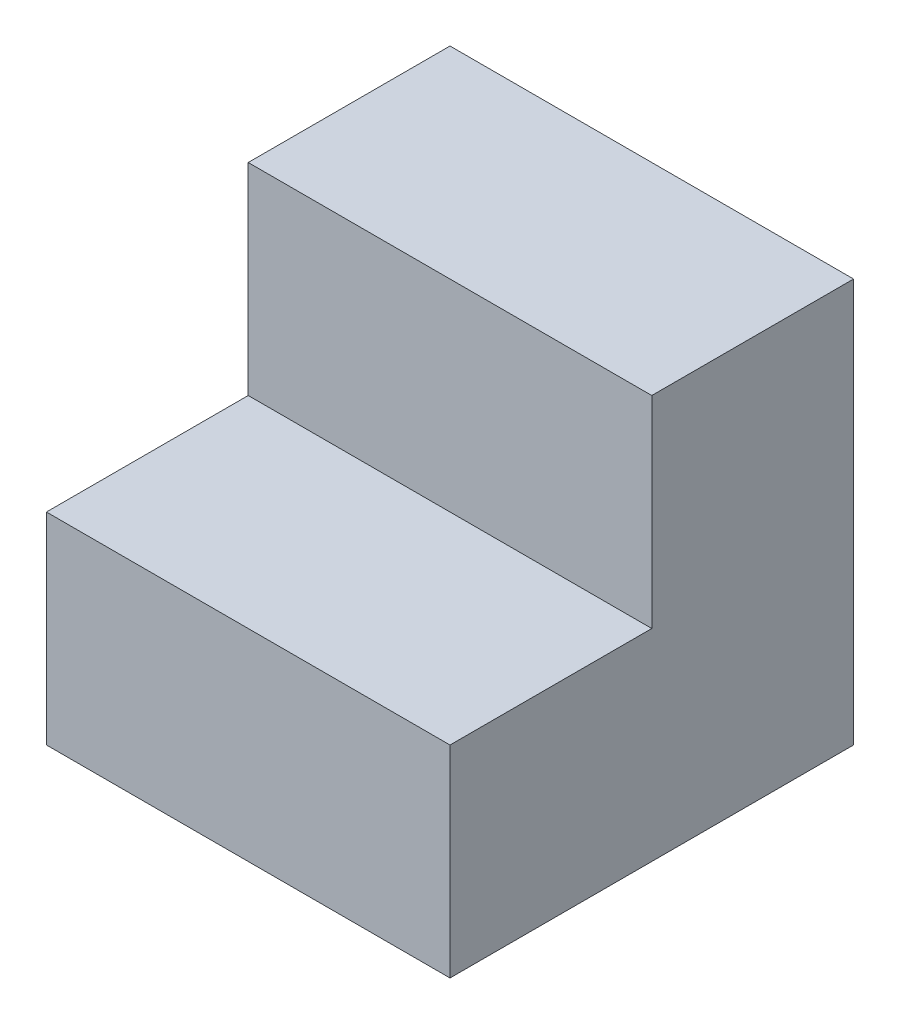
ISO-10303-21;
HEADER;
FILE_DESCRIPTION(('STEP AP214'),'2;1');
FILE_NAME('part.step','',(''),(''),'','','');
FILE_SCHEMA(('AUTOMOTIVE_DESIGN { 1 0 10303 214 1 1 1 1 }'));
ENDSEC;
DATA;
#1=APPLICATION_CONTEXT('core data for automotive mechanical design processes');
#2=APPLICATION_PROTOCOL_DEFINITION('international standard','automotive_design',2000,#1);
#3=PRODUCT_CONTEXT('',#1,'mechanical');
#4=PRODUCT('Part','Part','',(#3));
#5=PRODUCT_RELATED_PRODUCT_CATEGORY('part','',(#4));
#6=PRODUCT_DEFINITION_FORMATION('','',#4);
#7=PRODUCT_DEFINITION_CONTEXT('part definition',#1,'design');
#8=PRODUCT_DEFINITION('design','',#6,#7);
#9=PRODUCT_DEFINITION_SHAPE('','',#8);
#10=(LENGTH_UNIT() NAMED_UNIT(*) SI_UNIT(.MILLI.,.METRE.));
#11=(NAMED_UNIT(*) PLANE_ANGLE_UNIT() SI_UNIT($,.RADIAN.));
#12=(NAMED_UNIT(*) SI_UNIT($,.STERADIAN.) SOLID_ANGLE_UNIT());
#13=UNCERTAINTY_MEASURE_WITH_UNIT(LENGTH_MEASURE(1.E-05),#10,'distance_accuracy_value','');
#14=(GEOMETRIC_REPRESENTATION_CONTEXT(3) GLOBAL_UNCERTAINTY_ASSIGNED_CONTEXT((#13)) GLOBAL_UNIT_ASSIGNED_CONTEXT((#10,
#11,#12)) REPRESENTATION_CONTEXT('',''));
#15=CARTESIAN_POINT('',(0.,0.,0.));
#16=DIRECTION('',(0.,0.,1.));
#17=DIRECTION('',(1.,0.,0.));
#18=AXIS2_PLACEMENT_3D('',#15,#16,#17);
#19=CARTESIAN_POINT('',(40.,80.,0.));
#20=DIRECTION('',(0.,-1.,0.));
#21=DIRECTION('',(0.,0.,-1.));
#22=AXIS2_PLACEMENT_3D('',#19,#20,#21);
#23=PLANE('',#22);
#24=DIRECTION('',(0.,0.,1.));
#25=VECTOR('',#24,1.);
#26=CARTESIAN_POINT('',(-40.,80.,0.));
#27=LINE('',#26,#25);
#28=CARTESIAN_POINT('',(-40.,80.,0.));
#29=VERTEX_POINT('',#28);
#30=CARTESIAN_POINT('',(-40.,80.,40.));
#31=VERTEX_POINT('',#30);
#32=EDGE_CURVE('E120',#29,#31,#27,.T.);
#33=ORIENTED_EDGE('',*,*,#32,.T.);
#34=DIRECTION('',(-1.,0.,0.));
#35=VECTOR('',#34,1.);
#36=CARTESIAN_POINT('',(40.,80.,40.));
#37=LINE('',#36,#35);
#38=CARTESIAN_POINT('',(40.,80.,40.));
#39=VERTEX_POINT('',#38);
#40=EDGE_CURVE('E11',#39,#31,#37,.T.);
#41=ORIENTED_EDGE('',*,*,#40,.F.);
#42=DIRECTION('',(0.,0.,1.));
#43=VECTOR('',#42,1.);
#44=CARTESIAN_POINT('',(40.,80.,0.));
#45=LINE('',#44,#43);
#46=CARTESIAN_POINT('',(40.,80.,0.));
#47=VERTEX_POINT('',#46);
#48=EDGE_CURVE('E130',#47,#39,#45,.T.);
#49=ORIENTED_EDGE('',*,*,#48,.F.);
#50=DIRECTION('',(-1.,0.,0.));
#51=VECTOR('',#50,1.);
#52=CARTESIAN_POINT('',(40.,80.,0.));
#53=LINE('',#52,#51);
#54=EDGE_CURVE('E116',#47,#29,#53,.T.);
#55=ORIENTED_EDGE('',*,*,#54,.T.);
#56=EDGE_LOOP('',(#33,#41,#49,#55));
#57=FACE_BOUND('',#56,.T.);
#58=ADVANCED_FACE('F36',(#57),#23,.F.);
#59=CARTESIAN_POINT('',(40.,80.,40.));
#60=DIRECTION('',(0.,0.,-1.));
#61=DIRECTION('',(-1.,0.,0.));
#62=AXIS2_PLACEMENT_3D('',#59,#60,#61);
#63=PLANE('',#62);
#64=DIRECTION('',(0.,-1.,0.));
#65=VECTOR('',#64,1.);
#66=CARTESIAN_POINT('',(-40.,80.,40.));
#67=LINE('',#66,#65);
#68=CARTESIAN_POINT('',(-40.,40.,40.));
#69=VERTEX_POINT('',#68);
#70=EDGE_CURVE('E123',#31,#69,#67,.T.);
#71=ORIENTED_EDGE('',*,*,#70,.T.);
#72=DIRECTION('',(-1.,0.,0.));
#73=VECTOR('',#72,1.);
#74=CARTESIAN_POINT('',(40.,40.,40.));
#75=LINE('',#74,#73);
#76=CARTESIAN_POINT('',(40.,40.,40.));
#77=VERTEX_POINT('',#76);
#78=EDGE_CURVE('E44',#77,#69,#75,.T.);
#79=ORIENTED_EDGE('',*,*,#78,.F.);
#80=DIRECTION('',(0.,-1.,0.));
#81=VECTOR('',#80,1.);
#82=CARTESIAN_POINT('',(40.,80.,40.));
#83=LINE('',#82,#81);
#84=EDGE_CURVE('E89',#39,#77,#83,.T.);
#85=ORIENTED_EDGE('',*,*,#84,.F.);
#86=ORIENTED_EDGE('',*,*,#40,.T.);
#87=EDGE_LOOP('',(#71,#79,#85,#86));
#88=FACE_BOUND('',#87,.T.);
#89=ADVANCED_FACE('F154',(#88),#63,.F.);
#90=CARTESIAN_POINT('',(40.,40.,40.));
#91=DIRECTION('',(0.,-1.,0.));
#92=DIRECTION('',(0.,0.,-1.));
#93=AXIS2_PLACEMENT_3D('',#90,#91,#92);
#94=PLANE('',#93);
#95=DIRECTION('',(0.,0.,1.));
#96=VECTOR('',#95,1.);
#97=CARTESIAN_POINT('',(-40.,40.,40.));
#98=LINE('',#97,#96);
#99=CARTESIAN_POINT('',(-40.,40.,80.));
#100=VERTEX_POINT('',#99);
#101=EDGE_CURVE('E125',#69,#100,#98,.T.);
#102=ORIENTED_EDGE('',*,*,#101,.T.);
#103=DIRECTION('',(-1.,0.,0.));
#104=VECTOR('',#103,1.);
#105=CARTESIAN_POINT('',(40.,40.,80.));
#106=LINE('',#105,#104);
#107=CARTESIAN_POINT('',(40.,40.,80.));
#108=VERTEX_POINT('',#107);
#109=EDGE_CURVE('E111',#108,#100,#106,.T.);
#110=ORIENTED_EDGE('',*,*,#109,.F.);
#111=DIRECTION('',(0.,0.,1.));
#112=VECTOR('',#111,1.);
#113=CARTESIAN_POINT('',(40.,40.,40.));
#114=LINE('',#113,#112);
#115=EDGE_CURVE('E102',#77,#108,#114,.T.);
#116=ORIENTED_EDGE('',*,*,#115,.F.);
#117=ORIENTED_EDGE('',*,*,#78,.T.);
#118=EDGE_LOOP('',(#102,#110,#116,#117));
#119=FACE_BOUND('',#118,.T.);
#120=ADVANCED_FACE('F136',(#119),#94,.F.);
#121=CARTESIAN_POINT('',(40.,0.,80.));
#122=DIRECTION('',(0.,0.,-1.));
#123=DIRECTION('',(-1.,0.,0.));
#124=AXIS2_PLACEMENT_3D('',#121,#122,#123);
#125=PLANE('',#124);
#126=DIRECTION('',(0.,-1.,0.));
#127=VECTOR('',#126,1.);
#128=CARTESIAN_POINT('',(-40.,0.,80.));
#129=LINE('',#128,#127);
#130=CARTESIAN_POINT('',(-40.,0.,80.));
#131=VERTEX_POINT('',#130);
#132=EDGE_CURVE('E110',#100,#131,#129,.T.);
#133=ORIENTED_EDGE('',*,*,#132,.T.);
#134=DIRECTION('',(-1.,0.,0.));
#135=VECTOR('',#134,1.);
#136=CARTESIAN_POINT('',(40.,0.,80.));
#137=LINE('',#136,#135);
#138=CARTESIAN_POINT('',(40.,0.,80.));
#139=VERTEX_POINT('',#138);
#140=EDGE_CURVE('E107',#139,#131,#137,.T.);
#141=ORIENTED_EDGE('',*,*,#140,.F.);
#142=DIRECTION('',(0.,-1.,0.));
#143=VECTOR('',#142,1.);
#144=CARTESIAN_POINT('',(40.,0.,80.));
#145=LINE('',#144,#143);
#146=EDGE_CURVE('E96',#108,#139,#145,.T.);
#147=ORIENTED_EDGE('',*,*,#146,.F.);
#148=ORIENTED_EDGE('',*,*,#109,.T.);
#149=EDGE_LOOP('',(#133,#141,#147,#148));
#150=FACE_BOUND('',#149,.T.);
#151=ADVANCED_FACE('F108',(#150),#125,.F.);
#152=CARTESIAN_POINT('',(40.,0.,0.));
#153=DIRECTION('',(0.,1.,0.));
#154=DIRECTION('',(0.,0.,1.));
#155=AXIS2_PLACEMENT_3D('',#152,#153,#154);
#156=PLANE('',#155);
#157=DIRECTION('',(0.,0.,-1.));
#158=VECTOR('',#157,1.);
#159=CARTESIAN_POINT('',(-40.,0.,0.));
#160=LINE('',#159,#158);
#161=CARTESIAN_POINT('',(-40.,0.,0.));
#162=VERTEX_POINT('',#161);
#163=EDGE_CURVE('E75',#131,#162,#160,.T.);
#164=ORIENTED_EDGE('',*,*,#163,.T.);
#165=DIRECTION('',(-1.,0.,0.));
#166=VECTOR('',#165,1.);
#167=CARTESIAN_POINT('',(40.,0.,0.));
#168=LINE('',#167,#166);
#169=CARTESIAN_POINT('',(40.,0.,0.));
#170=VERTEX_POINT('',#169);
#171=EDGE_CURVE('E112',#170,#162,#168,.T.);
#172=ORIENTED_EDGE('',*,*,#171,.F.);
#173=DIRECTION('',(0.,0.,-1.));
#174=VECTOR('',#173,1.);
#175=CARTESIAN_POINT('',(40.,0.,0.));
#176=LINE('',#175,#174);
#177=EDGE_CURVE('E100',#139,#170,#176,.T.);
#178=ORIENTED_EDGE('',*,*,#177,.F.);
#179=ORIENTED_EDGE('',*,*,#140,.T.);
#180=EDGE_LOOP('',(#164,#172,#178,#179));
#181=FACE_BOUND('',#180,.T.);
#182=ADVANCED_FACE('F114',(#181),#156,.F.);
#183=CARTESIAN_POINT('',(40.,80.,0.));
#184=DIRECTION('',(0.,0.,1.));
#185=DIRECTION('',(1.,0.,0.));
#186=AXIS2_PLACEMENT_3D('',#183,#184,#185);
#187=PLANE('',#186);
#188=DIRECTION('',(0.,1.,0.));
#189=VECTOR('',#188,1.);
#190=CARTESIAN_POINT('',(-40.,80.,0.));
#191=LINE('',#190,#189);
#192=EDGE_CURVE('E81',#162,#29,#191,.T.);
#193=ORIENTED_EDGE('',*,*,#192,.T.);
#194=ORIENTED_EDGE('',*,*,#54,.F.);
#195=DIRECTION('',(0.,1.,0.));
#196=VECTOR('',#195,1.);
#197=CARTESIAN_POINT('',(40.,80.,0.));
#198=LINE('',#197,#196);
#199=EDGE_CURVE('E52',#170,#47,#198,.T.);
#200=ORIENTED_EDGE('',*,*,#199,.F.);
#201=ORIENTED_EDGE('',*,*,#171,.T.);
#202=EDGE_LOOP('',(#193,#194,#200,#201));
#203=FACE_BOUND('',#202,.T.);
#204=ADVANCED_FACE('F143',(#203),#187,.F.);
#205=CARTESIAN_POINT('',(40.,0.,0.));
#206=DIRECTION('',(1.,0.,0.));
#207=DIRECTION('',(0.,0.,-1.));
#208=AXIS2_PLACEMENT_3D('',#205,#206,#207);
#209=PLANE('',#208);
#210=ORIENTED_EDGE('',*,*,#48,.T.);
#211=ORIENTED_EDGE('',*,*,#84,.T.);
#212=ORIENTED_EDGE('',*,*,#115,.T.);
#213=ORIENTED_EDGE('',*,*,#146,.T.);
#214=ORIENTED_EDGE('',*,*,#177,.T.);
#215=ORIENTED_EDGE('',*,*,#199,.T.);
#216=EDGE_LOOP('',(#210,#211,#212,#213,#214,#215));
#217=FACE_BOUND('',#216,.T.);
#218=ADVANCED_FACE('F98',(#217),#209,.T.);
#219=CARTESIAN_POINT('',(-40.,0.,0.));
#220=DIRECTION('',(1.,0.,0.));
#221=DIRECTION('',(0.,0.,-1.));
#222=AXIS2_PLACEMENT_3D('',#219,#220,#221);
#223=PLANE('',#222);
#224=ORIENTED_EDGE('',*,*,#32,.F.);
#225=ORIENTED_EDGE('',*,*,#192,.F.);
#226=ORIENTED_EDGE('',*,*,#163,.F.);
#227=ORIENTED_EDGE('',*,*,#132,.F.);
#228=ORIENTED_EDGE('',*,*,#101,.F.);
#229=ORIENTED_EDGE('',*,*,#70,.F.);
#230=EDGE_LOOP('',(#224,#225,#226,#227,#228,#229));
#231=FACE_BOUND('',#230,.T.);
#232=ADVANCED_FACE('F139',(#231),#223,.F.);
#233=CLOSED_SHELL('',(#58,#89,#120,#151,#182,#204,#218,#232));
#234=MANIFOLD_SOLID_BREP('B2',#233);
#235=ADVANCED_BREP_SHAPE_REPRESENTATION('',(#18,#234),#14);
#236=SHAPE_DEFINITION_REPRESENTATION(#9,#235);
ENDSEC;
END-ISO-10303-21;
